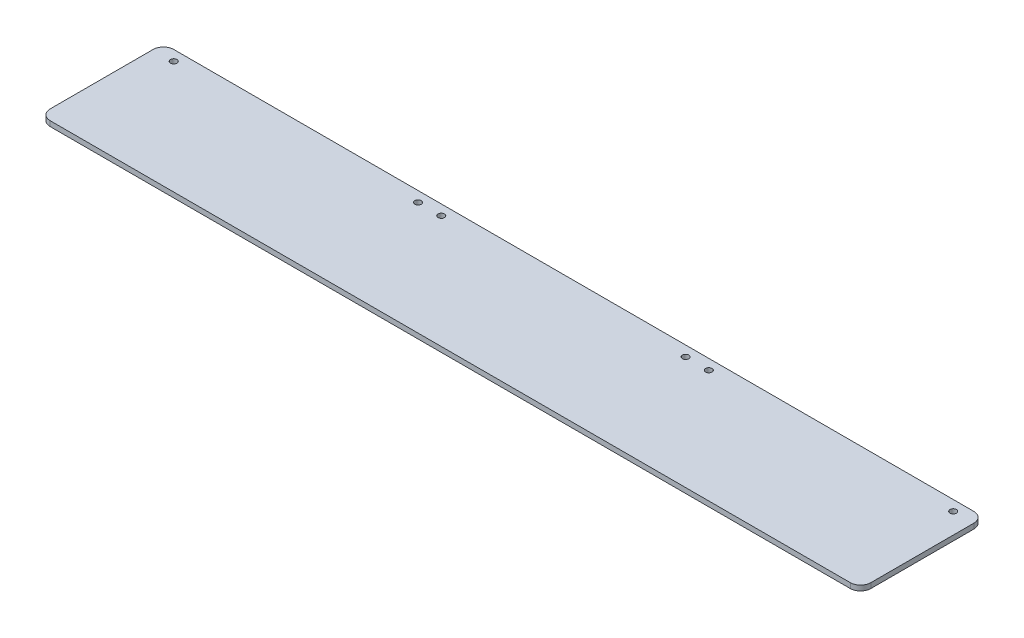
ISO-10303-21;
HEADER;
FILE_DESCRIPTION(('STEP AP214'),'2;1');
FILE_NAME('part.step','',(''),(''),'','','');
FILE_SCHEMA(('AUTOMOTIVE_DESIGN { 1 0 10303 214 1 1 1 1 }'));
ENDSEC;
DATA;
#1=APPLICATION_CONTEXT('core data for automotive mechanical design processes');
#2=APPLICATION_PROTOCOL_DEFINITION('international standard','automotive_design',2000,#1);
#3=PRODUCT_CONTEXT('',#1,'mechanical');
#4=PRODUCT('Part','Part','',(#3));
#5=PRODUCT_RELATED_PRODUCT_CATEGORY('part','',(#4));
#6=PRODUCT_DEFINITION_FORMATION('','',#4);
#7=PRODUCT_DEFINITION_CONTEXT('part definition',#1,'design');
#8=PRODUCT_DEFINITION('design','',#6,#7);
#9=PRODUCT_DEFINITION_SHAPE('','',#8);
#10=(LENGTH_UNIT() NAMED_UNIT(*) SI_UNIT(.MILLI.,.METRE.));
#11=(NAMED_UNIT(*) PLANE_ANGLE_UNIT() SI_UNIT($,.RADIAN.));
#12=(NAMED_UNIT(*) SI_UNIT($,.STERADIAN.) SOLID_ANGLE_UNIT());
#13=UNCERTAINTY_MEASURE_WITH_UNIT(LENGTH_MEASURE(1.E-05),#10,'distance_accuracy_value','');
#14=(GEOMETRIC_REPRESENTATION_CONTEXT(3) GLOBAL_UNCERTAINTY_ASSIGNED_CONTEXT((#13)) GLOBAL_UNIT_ASSIGNED_CONTEXT((#10,
#11,#12)) REPRESENTATION_CONTEXT('',''));
#15=CARTESIAN_POINT('',(0.,0.,0.));
#16=DIRECTION('',(0.,0.,1.));
#17=DIRECTION('',(1.,0.,0.));
#18=AXIS2_PLACEMENT_3D('',#15,#16,#17);
#19=CARTESIAN_POINT('',(2000.25000000001,12.7,-25.4));
#20=DIRECTION('',(0.,-1.,0.));
#21=DIRECTION('',(0.,0.,-1.));
#22=AXIS2_PLACEMENT_3D('',#19,#20,#21);
#23=PLANE('',#22);
#24=CARTESIAN_POINT('',(2000.25000000001,12.7,-25.4));
#25=DIRECTION('',(0.,1.,0.));
#26=DIRECTION('',(0.,0.,-1.));
#27=AXIS2_PLACEMENT_3D('',#24,#25,#26);
#28=CIRCLE('',#27,25.3999999999999);
#29=CARTESIAN_POINT('',(2000.25000000001,12.7,0.));
#30=VERTEX_POINT('',#29);
#31=CARTESIAN_POINT('',(2025.65000000001,12.7,-25.4));
#32=VERTEX_POINT('',#31);
#33=EDGE_CURVE('E146',#30,#32,#28,.T.);
#34=ORIENTED_EDGE('',*,*,#33,.T.);
#35=DIRECTION('',(0.,0.,-1.));
#36=VECTOR('',#35,1.);
#37=CARTESIAN_POINT('',(2025.65000000001,12.7,-25.4));
#38=LINE('',#37,#36);
#39=CARTESIAN_POINT('',(2025.65000000001,12.7,-279.4));
#40=VERTEX_POINT('',#39);
#41=EDGE_CURVE('E94',#32,#40,#38,.T.);
#42=ORIENTED_EDGE('',*,*,#41,.T.);
#43=CARTESIAN_POINT('',(2000.25000000001,12.7,-279.4));
#44=DIRECTION('',(0.,1.,0.));
#45=DIRECTION('',(0.,0.,-1.));
#46=AXIS2_PLACEMENT_3D('',#43,#44,#45);
#47=CIRCLE('',#46,25.3999999999999);
#48=CARTESIAN_POINT('',(2000.25000000001,12.7,-304.8));
#49=VERTEX_POINT('',#48);
#50=EDGE_CURVE('E161',#40,#49,#47,.T.);
#51=ORIENTED_EDGE('',*,*,#50,.T.);
#52=DIRECTION('',(-1.,0.,0.));
#53=VECTOR('',#52,1.);
#54=CARTESIAN_POINT('',(25.3999999999996,12.7,-304.800000000007));
#55=LINE('',#54,#53);
#56=CARTESIAN_POINT('',(25.3999999999996,12.7,-304.800000000007));
#57=VERTEX_POINT('',#56);
#58=EDGE_CURVE('E174',#49,#57,#55,.T.);
#59=ORIENTED_EDGE('',*,*,#58,.T.);
#60=CARTESIAN_POINT('',(25.4,12.7,-279.40000000002));
#61=DIRECTION('',(0.,1.,0.));
#62=DIRECTION('',(0.,0.,-1.));
#63=AXIS2_PLACEMENT_3D('',#60,#61,#62);
#64=CIRCLE('',#63,25.3999999999933);
#65=CARTESIAN_POINT('',(6.6717464886068E-12,12.7,-279.400000000007));
#66=VERTEX_POINT('',#65);
#67=EDGE_CURVE('E113',#57,#66,#64,.T.);
#68=ORIENTED_EDGE('',*,*,#67,.T.);
#69=DIRECTION('',(0.,0.,1.));
#70=VECTOR('',#69,1.);
#71=CARTESIAN_POINT('',(0.,12.7,-25.4000000000002));
#72=LINE('',#71,#70);
#73=CARTESIAN_POINT('',(0.,12.7,-25.4000000000002));
#74=VERTEX_POINT('',#73);
#75=EDGE_CURVE('E107',#66,#74,#72,.T.);
#76=ORIENTED_EDGE('',*,*,#75,.T.);
#77=CARTESIAN_POINT('',(25.4,12.7,-25.4));
#78=DIRECTION('',(0.,1.,0.));
#79=DIRECTION('',(0.,0.,1.));
#80=AXIS2_PLACEMENT_3D('',#77,#78,#79);
#81=CIRCLE('',#80,25.4);
#82=CARTESIAN_POINT('',(25.4,12.7,0.));
#83=VERTEX_POINT('',#82);
#84=EDGE_CURVE('E111',#74,#83,#81,.T.);
#85=ORIENTED_EDGE('',*,*,#84,.T.);
#86=DIRECTION('',(1.,0.,0.));
#87=VECTOR('',#86,1.);
#88=CARTESIAN_POINT('',(25.4000000000002,12.7,0.));
#89=LINE('',#88,#87);
#90=EDGE_CURVE('E51',#83,#30,#89,.T.);
#91=ORIENTED_EDGE('',*,*,#90,.T.);
#92=EDGE_LOOP('',(#34,#42,#51,#59,#68,#76,#85,#91));
#93=FACE_BOUND('',#92,.T.);
#94=CARTESIAN_POINT('',(50.8,12.7,-279.400000000007));
#95=DIRECTION('',(0.,1.,0.));
#96=DIRECTION('',(0.,0.,1.));
#97=AXIS2_PLACEMENT_3D('',#94,#95,#96);
#98=CIRCLE('',#97,7.93749999999794);
#99=CARTESIAN_POINT('',(50.8,12.7,-271.462500000009));
#100=VERTEX_POINT('',#99);
#101=EDGE_CURVE('E135',#100,#100,#98,.T.);
#102=ORIENTED_EDGE('',*,*,#101,.F.);
#103=EDGE_LOOP('',(#102));
#104=FACE_BOUND('',#103,.T.);
#105=CARTESIAN_POINT('',(654.05,12.7,-279.399999999999));
#106=DIRECTION('',(0.,1.,0.));
#107=DIRECTION('',(0.,0.,1.));
#108=AXIS2_PLACEMENT_3D('',#105,#106,#107);
#109=CIRCLE('',#108,7.93750000000026);
#110=CARTESIAN_POINT('',(654.05,12.7,-271.462499999999));
#111=VERTEX_POINT('',#110);
#112=EDGE_CURVE('E183',#111,#111,#109,.T.);
#113=ORIENTED_EDGE('',*,*,#112,.F.);
#114=EDGE_LOOP('',(#113));
#115=FACE_BOUND('',#114,.T.);
#116=CARTESIAN_POINT('',(711.2,12.7,-279.4));
#117=DIRECTION('',(0.,1.,0.));
#118=DIRECTION('',(0.,0.,1.));
#119=AXIS2_PLACEMENT_3D('',#116,#117,#118);
#120=CIRCLE('',#119,7.93750000000026);
#121=CARTESIAN_POINT('',(711.2,12.7,-271.4625));
#122=VERTEX_POINT('',#121);
#123=EDGE_CURVE('E189',#122,#122,#120,.T.);
#124=ORIENTED_EDGE('',*,*,#123,.F.);
#125=EDGE_LOOP('',(#124));
#126=FACE_BOUND('',#125,.T.);
#127=CARTESIAN_POINT('',(1314.45000000001,12.7,-279.400000000001));
#128=DIRECTION('',(0.,1.,0.));
#129=DIRECTION('',(0.,0.,-1.));
#130=AXIS2_PLACEMENT_3D('',#127,#128,#129);
#131=CIRCLE('',#130,7.93750000000044);
#132=CARTESIAN_POINT('',(1314.45000000001,12.7,-287.337500000001));
#133=VERTEX_POINT('',#132);
#134=EDGE_CURVE('E195',#133,#133,#131,.T.);
#135=ORIENTED_EDGE('',*,*,#134,.F.);
#136=EDGE_LOOP('',(#135));
#137=FACE_BOUND('',#136,.T.);
#138=CARTESIAN_POINT('',(1371.60000000001,12.7,-279.4));
#139=DIRECTION('',(0.,1.,0.));
#140=DIRECTION('',(0.,0.,-1.));
#141=AXIS2_PLACEMENT_3D('',#138,#139,#140);
#142=CIRCLE('',#141,7.93750000000089);
#143=CARTESIAN_POINT('',(1371.60000000001,12.7,-287.337500000001));
#144=VERTEX_POINT('',#143);
#145=EDGE_CURVE('E201',#144,#144,#142,.T.);
#146=ORIENTED_EDGE('',*,*,#145,.F.);
#147=EDGE_LOOP('',(#146));
#148=FACE_BOUND('',#147,.T.);
#149=CARTESIAN_POINT('',(1974.85000000001,12.7,-279.4));
#150=DIRECTION('',(0.,1.,0.));
#151=DIRECTION('',(0.,0.,-1.));
#152=AXIS2_PLACEMENT_3D('',#149,#150,#151);
#153=CIRCLE('',#152,7.93749999999998);
#154=CARTESIAN_POINT('',(1974.85000000001,12.7,-287.3375));
#155=VERTEX_POINT('',#154);
#156=EDGE_CURVE('E207',#155,#155,#153,.T.);
#157=ORIENTED_EDGE('',*,*,#156,.F.);
#158=EDGE_LOOP('',(#157));
#159=FACE_BOUND('',#158,.T.);
#160=ADVANCED_FACE('F34',(#93,#104,#115,#126,#137,#148,#159),#23,.F.);
#161=CARTESIAN_POINT('',(2000.25000000001,0.,-25.4));
#162=DIRECTION('',(0.,-1.,0.));
#163=DIRECTION('',(0.,0.,-1.));
#164=AXIS2_PLACEMENT_3D('',#161,#162,#163);
#165=PLANE('',#164);
#166=CARTESIAN_POINT('',(1371.60000000001,0.,-279.4));
#167=DIRECTION('',(0.,1.,0.));
#168=DIRECTION('',(0.,0.,-1.));
#169=AXIS2_PLACEMENT_3D('',#166,#167,#168);
#170=CIRCLE('',#169,7.93750000000089);
#171=CARTESIAN_POINT('',(1371.60000000001,0.,-287.337500000001));
#172=VERTEX_POINT('',#171);
#173=EDGE_CURVE('E204',#172,#172,#170,.T.);
#174=ORIENTED_EDGE('',*,*,#173,.T.);
#175=EDGE_LOOP('',(#174));
#176=FACE_BOUND('',#175,.T.);
#177=CARTESIAN_POINT('',(711.2,0.,-279.4));
#178=DIRECTION('',(0.,1.,0.));
#179=DIRECTION('',(0.,0.,1.));
#180=AXIS2_PLACEMENT_3D('',#177,#178,#179);
#181=CIRCLE('',#180,7.93750000000026);
#182=CARTESIAN_POINT('',(711.2,0.,-271.4625));
#183=VERTEX_POINT('',#182);
#184=EDGE_CURVE('E192',#183,#183,#181,.T.);
#185=ORIENTED_EDGE('',*,*,#184,.T.);
#186=EDGE_LOOP('',(#185));
#187=FACE_BOUND('',#186,.T.);
#188=CARTESIAN_POINT('',(50.8,0.,-279.400000000007));
#189=DIRECTION('',(0.,1.,0.));
#190=DIRECTION('',(0.,0.,1.));
#191=AXIS2_PLACEMENT_3D('',#188,#189,#190);
#192=CIRCLE('',#191,7.93749999999794);
#193=CARTESIAN_POINT('',(50.8,0.,-271.462500000009));
#194=VERTEX_POINT('',#193);
#195=EDGE_CURVE('E180',#194,#194,#192,.T.);
#196=ORIENTED_EDGE('',*,*,#195,.T.);
#197=EDGE_LOOP('',(#196));
#198=FACE_BOUND('',#197,.T.);
#199=CARTESIAN_POINT('',(2000.25000000001,0.,-25.4));
#200=DIRECTION('',(0.,1.,0.));
#201=DIRECTION('',(0.,0.,-1.));
#202=AXIS2_PLACEMENT_3D('',#199,#200,#201);
#203=CIRCLE('',#202,25.3999999999999);
#204=CARTESIAN_POINT('',(2000.25000000001,0.,0.));
#205=VERTEX_POINT('',#204);
#206=CARTESIAN_POINT('',(2025.65000000001,0.,-25.4));
#207=VERTEX_POINT('',#206);
#208=EDGE_CURVE('E131',#205,#207,#203,.T.);
#209=ORIENTED_EDGE('',*,*,#208,.F.);
#210=DIRECTION('',(1.,0.,0.));
#211=VECTOR('',#210,1.);
#212=CARTESIAN_POINT('',(25.4000000000002,0.,0.));
#213=LINE('',#212,#211);
#214=CARTESIAN_POINT('',(25.4,0.,0.));
#215=VERTEX_POINT('',#214);
#216=EDGE_CURVE('E86',#215,#205,#213,.T.);
#217=ORIENTED_EDGE('',*,*,#216,.F.);
#218=CARTESIAN_POINT('',(25.4,0.,-25.4));
#219=DIRECTION('',(0.,1.,0.));
#220=DIRECTION('',(0.,0.,1.));
#221=AXIS2_PLACEMENT_3D('',#218,#219,#220);
#222=CIRCLE('',#221,25.4);
#223=CARTESIAN_POINT('',(0.,0.,-25.4000000000002));
#224=VERTEX_POINT('',#223);
#225=EDGE_CURVE('E80',#224,#215,#222,.T.);
#226=ORIENTED_EDGE('',*,*,#225,.F.);
#227=DIRECTION('',(0.,0.,1.));
#228=VECTOR('',#227,1.);
#229=CARTESIAN_POINT('',(0.,0.,-25.4000000000002));
#230=LINE('',#229,#228);
#231=CARTESIAN_POINT('',(6.6717464886068E-12,0.,-279.400000000007));
#232=VERTEX_POINT('',#231);
#233=EDGE_CURVE('E121',#232,#224,#230,.T.);
#234=ORIENTED_EDGE('',*,*,#233,.F.);
#235=CARTESIAN_POINT('',(25.4,0.,-279.40000000002));
#236=DIRECTION('',(0.,1.,0.));
#237=DIRECTION('',(0.,0.,-1.));
#238=AXIS2_PLACEMENT_3D('',#235,#236,#237);
#239=CIRCLE('',#238,25.3999999999933);
#240=CARTESIAN_POINT('',(25.3999999999996,0.,-304.800000000007));
#241=VERTEX_POINT('',#240);
#242=EDGE_CURVE('E141',#241,#232,#239,.T.);
#243=ORIENTED_EDGE('',*,*,#242,.F.);
#244=DIRECTION('',(-1.,0.,0.));
#245=VECTOR('',#244,1.);
#246=CARTESIAN_POINT('',(25.3999999999996,0.,-304.800000000007));
#247=LINE('',#246,#245);
#248=CARTESIAN_POINT('',(2000.25000000001,0.,-304.8));
#249=VERTEX_POINT('',#248);
#250=EDGE_CURVE('E139',#249,#241,#247,.T.);
#251=ORIENTED_EDGE('',*,*,#250,.F.);
#252=CARTESIAN_POINT('',(2000.25000000001,0.,-279.4));
#253=DIRECTION('',(0.,1.,0.));
#254=DIRECTION('',(0.,0.,-1.));
#255=AXIS2_PLACEMENT_3D('',#252,#253,#254);
#256=CIRCLE('',#255,25.3999999999999);
#257=CARTESIAN_POINT('',(2025.65000000001,0.,-279.4));
#258=VERTEX_POINT('',#257);
#259=EDGE_CURVE('E137',#258,#249,#256,.T.);
#260=ORIENTED_EDGE('',*,*,#259,.F.);
#261=DIRECTION('',(0.,0.,-1.));
#262=VECTOR('',#261,1.);
#263=CARTESIAN_POINT('',(2025.65000000001,0.,-25.4));
#264=LINE('',#263,#262);
#265=EDGE_CURVE('E134',#207,#258,#264,.T.);
#266=ORIENTED_EDGE('',*,*,#265,.F.);
#267=EDGE_LOOP('',(#209,#217,#226,#234,#243,#251,#260,#266));
#268=FACE_BOUND('',#267,.T.);
#269=CARTESIAN_POINT('',(654.05,0.,-279.399999999999));
#270=DIRECTION('',(0.,1.,0.));
#271=DIRECTION('',(0.,0.,1.));
#272=AXIS2_PLACEMENT_3D('',#269,#270,#271);
#273=CIRCLE('',#272,7.93750000000026);
#274=CARTESIAN_POINT('',(654.05,0.,-271.462499999999));
#275=VERTEX_POINT('',#274);
#276=EDGE_CURVE('E186',#275,#275,#273,.T.);
#277=ORIENTED_EDGE('',*,*,#276,.T.);
#278=EDGE_LOOP('',(#277));
#279=FACE_BOUND('',#278,.T.);
#280=CARTESIAN_POINT('',(1314.45000000001,0.,-279.400000000001));
#281=DIRECTION('',(0.,1.,0.));
#282=DIRECTION('',(0.,0.,-1.));
#283=AXIS2_PLACEMENT_3D('',#280,#281,#282);
#284=CIRCLE('',#283,7.93750000000044);
#285=CARTESIAN_POINT('',(1314.45000000001,0.,-287.337500000001));
#286=VERTEX_POINT('',#285);
#287=EDGE_CURVE('E198',#286,#286,#284,.T.);
#288=ORIENTED_EDGE('',*,*,#287,.T.);
#289=EDGE_LOOP('',(#288));
#290=FACE_BOUND('',#289,.T.);
#291=CARTESIAN_POINT('',(1974.85000000001,0.,-279.4));
#292=DIRECTION('',(0.,1.,0.));
#293=DIRECTION('',(0.,0.,-1.));
#294=AXIS2_PLACEMENT_3D('',#291,#292,#293);
#295=CIRCLE('',#294,7.93749999999998);
#296=CARTESIAN_POINT('',(1974.85000000001,0.,-287.3375));
#297=VERTEX_POINT('',#296);
#298=EDGE_CURVE('E210',#297,#297,#295,.T.);
#299=ORIENTED_EDGE('',*,*,#298,.T.);
#300=EDGE_LOOP('',(#299));
#301=FACE_BOUND('',#300,.T.);
#302=ADVANCED_FACE('F165',(#176,#187,#198,#268,#279,#290,#301),#165,.T.);
#303=CARTESIAN_POINT('',(2000.25000000001,12.7,-25.4));
#304=DIRECTION('',(0.,-1.,0.));
#305=DIRECTION('',(0.,0.,-1.));
#306=AXIS2_PLACEMENT_3D('',#303,#304,#305);
#307=CYLINDRICAL_SURFACE('',#306,25.3999999999999);
#308=ORIENTED_EDGE('',*,*,#208,.T.);
#309=DIRECTION('',(0.,-1.,0.));
#310=VECTOR('',#309,1.);
#311=CARTESIAN_POINT('',(2025.65000000001,12.7,-25.4));
#312=LINE('',#311,#310);
#313=EDGE_CURVE('E11',#32,#207,#312,.T.);
#314=ORIENTED_EDGE('',*,*,#313,.F.);
#315=ORIENTED_EDGE('',*,*,#33,.F.);
#316=DIRECTION('',(0.,-1.,0.));
#317=VECTOR('',#316,1.);
#318=CARTESIAN_POINT('',(2000.25000000001,12.7,0.));
#319=LINE('',#318,#317);
#320=EDGE_CURVE('E127',#30,#205,#319,.T.);
#321=ORIENTED_EDGE('',*,*,#320,.T.);
#322=EDGE_LOOP('',(#308,#314,#315,#321));
#323=FACE_BOUND('',#322,.T.);
#324=ADVANCED_FACE('F36',(#323),#307,.T.);
#325=CARTESIAN_POINT('',(2025.65000000001,12.7,-25.4));
#326=DIRECTION('',(-1.,0.,0.));
#327=DIRECTION('',(0.,0.,1.));
#328=AXIS2_PLACEMENT_3D('',#325,#326,#327);
#329=PLANE('',#328);
#330=ORIENTED_EDGE('',*,*,#265,.T.);
#331=DIRECTION('',(0.,-1.,0.));
#332=VECTOR('',#331,1.);
#333=CARTESIAN_POINT('',(2025.65000000001,12.7,-279.4));
#334=LINE('',#333,#332);
#335=EDGE_CURVE('E43',#40,#258,#334,.T.);
#336=ORIENTED_EDGE('',*,*,#335,.F.);
#337=ORIENTED_EDGE('',*,*,#41,.F.);
#338=ORIENTED_EDGE('',*,*,#313,.T.);
#339=EDGE_LOOP('',(#330,#336,#337,#338));
#340=FACE_BOUND('',#339,.T.);
#341=ADVANCED_FACE('F242',(#340),#329,.F.);
#342=CARTESIAN_POINT('',(2000.25000000001,12.7,-279.4));
#343=DIRECTION('',(0.,-1.,0.));
#344=DIRECTION('',(0.,0.,-1.));
#345=AXIS2_PLACEMENT_3D('',#342,#343,#344);
#346=CYLINDRICAL_SURFACE('',#345,25.3999999999999);
#347=ORIENTED_EDGE('',*,*,#259,.T.);
#348=DIRECTION('',(0.,-1.,0.));
#349=VECTOR('',#348,1.);
#350=CARTESIAN_POINT('',(2000.25000000001,12.7,-304.8));
#351=LINE('',#350,#349);
#352=EDGE_CURVE('E153',#49,#249,#351,.T.);
#353=ORIENTED_EDGE('',*,*,#352,.F.);
#354=ORIENTED_EDGE('',*,*,#50,.F.);
#355=ORIENTED_EDGE('',*,*,#335,.T.);
#356=EDGE_LOOP('',(#347,#353,#354,#355));
#357=FACE_BOUND('',#356,.T.);
#358=ADVANCED_FACE('F159',(#357),#346,.T.);
#359=CARTESIAN_POINT('',(25.3999999999996,12.7,-304.800000000007));
#360=DIRECTION('',(0.,0.,1.));
#361=DIRECTION('',(1.,0.,0.));
#362=AXIS2_PLACEMENT_3D('',#359,#360,#361);
#363=PLANE('',#362);
#364=ORIENTED_EDGE('',*,*,#250,.T.);
#365=DIRECTION('',(0.,-1.,0.));
#366=VECTOR('',#365,1.);
#367=CARTESIAN_POINT('',(25.3999999999996,12.7,-304.800000000007));
#368=LINE('',#367,#366);
#369=EDGE_CURVE('E150',#57,#241,#368,.T.);
#370=ORIENTED_EDGE('',*,*,#369,.F.);
#371=ORIENTED_EDGE('',*,*,#58,.F.);
#372=ORIENTED_EDGE('',*,*,#352,.T.);
#373=EDGE_LOOP('',(#364,#370,#371,#372));
#374=FACE_BOUND('',#373,.T.);
#375=ADVANCED_FACE('F170',(#374),#363,.F.);
#376=CARTESIAN_POINT('',(25.4,12.7,-279.40000000002));
#377=DIRECTION('',(0.,-1.,0.));
#378=DIRECTION('',(0.,0.,-1.));
#379=AXIS2_PLACEMENT_3D('',#376,#377,#378);
#380=CYLINDRICAL_SURFACE('',#379,25.3999999999933);
#381=ORIENTED_EDGE('',*,*,#242,.T.);
#382=DIRECTION('',(0.,-1.,0.));
#383=VECTOR('',#382,1.);
#384=CARTESIAN_POINT('',(6.6717464886068E-12,12.7,-279.400000000007));
#385=LINE('',#384,#383);
#386=EDGE_CURVE('E122',#66,#232,#385,.T.);
#387=ORIENTED_EDGE('',*,*,#386,.F.);
#388=ORIENTED_EDGE('',*,*,#67,.F.);
#389=ORIENTED_EDGE('',*,*,#369,.T.);
#390=EDGE_LOOP('',(#381,#387,#388,#389));
#391=FACE_BOUND('',#390,.T.);
#392=ADVANCED_FACE('F173',(#391),#380,.T.);
#393=CARTESIAN_POINT('',(0.,12.7,-25.4000000000002));
#394=DIRECTION('',(1.,0.,0.));
#395=DIRECTION('',(0.,0.,-1.));
#396=AXIS2_PLACEMENT_3D('',#393,#394,#395);
#397=PLANE('',#396);
#398=ORIENTED_EDGE('',*,*,#233,.T.);
#399=DIRECTION('',(0.,-1.,0.));
#400=VECTOR('',#399,1.);
#401=CARTESIAN_POINT('',(0.,12.7,-25.4000000000002));
#402=LINE('',#401,#400);
#403=EDGE_CURVE('E118',#74,#224,#402,.T.);
#404=ORIENTED_EDGE('',*,*,#403,.F.);
#405=ORIENTED_EDGE('',*,*,#75,.F.);
#406=ORIENTED_EDGE('',*,*,#386,.T.);
#407=EDGE_LOOP('',(#398,#404,#405,#406));
#408=FACE_BOUND('',#407,.T.);
#409=ADVANCED_FACE('F119',(#408),#397,.F.);
#410=CARTESIAN_POINT('',(25.4,12.7,-25.4));
#411=DIRECTION('',(0.,-1.,0.));
#412=DIRECTION('',(0.,0.,-1.));
#413=AXIS2_PLACEMENT_3D('',#410,#411,#412);
#414=CYLINDRICAL_SURFACE('',#413,25.4);
#415=ORIENTED_EDGE('',*,*,#225,.T.);
#416=DIRECTION('',(0.,-1.,0.));
#417=VECTOR('',#416,1.);
#418=CARTESIAN_POINT('',(25.4,12.7,0.));
#419=LINE('',#418,#417);
#420=EDGE_CURVE('E123',#83,#215,#419,.T.);
#421=ORIENTED_EDGE('',*,*,#420,.F.);
#422=ORIENTED_EDGE('',*,*,#84,.F.);
#423=ORIENTED_EDGE('',*,*,#403,.T.);
#424=EDGE_LOOP('',(#415,#421,#422,#423));
#425=FACE_BOUND('',#424,.T.);
#426=ADVANCED_FACE('F125',(#425),#414,.T.);
#427=CARTESIAN_POINT('',(25.4000000000002,12.7,0.));
#428=DIRECTION('',(0.,0.,-1.));
#429=DIRECTION('',(-1.,0.,0.));
#430=AXIS2_PLACEMENT_3D('',#427,#428,#429);
#431=PLANE('',#430);
#432=ORIENTED_EDGE('',*,*,#216,.T.);
#433=ORIENTED_EDGE('',*,*,#320,.F.);
#434=ORIENTED_EDGE('',*,*,#90,.F.);
#435=ORIENTED_EDGE('',*,*,#420,.T.);
#436=EDGE_LOOP('',(#432,#433,#434,#435));
#437=FACE_BOUND('',#436,.T.);
#438=ADVANCED_FACE('F230',(#437),#431,.F.);
#439=CARTESIAN_POINT('',(50.8,12.7,-279.400000000007));
#440=DIRECTION('',(0.,-1.,0.));
#441=DIRECTION('',(0.,0.,-1.));
#442=AXIS2_PLACEMENT_3D('',#439,#440,#441);
#443=CYLINDRICAL_SURFACE('',#442,7.93749999999794);
#444=ORIENTED_EDGE('',*,*,#101,.T.);
#445=EDGE_LOOP('',(#444));
#446=FACE_BOUND('',#445,.T.);
#447=ORIENTED_EDGE('',*,*,#195,.F.);
#448=EDGE_LOOP('',(#447));
#449=FACE_BOUND('',#448,.T.);
#450=ADVANCED_FACE('F227',(#446,#449),#443,.F.);
#451=CARTESIAN_POINT('',(654.05,12.7,-279.399999999999));
#452=DIRECTION('',(0.,-1.,0.));
#453=DIRECTION('',(0.,0.,-1.));
#454=AXIS2_PLACEMENT_3D('',#451,#452,#453);
#455=CYLINDRICAL_SURFACE('',#454,7.93750000000026);
#456=ORIENTED_EDGE('',*,*,#112,.T.);
#457=EDGE_LOOP('',(#456));
#458=FACE_BOUND('',#457,.T.);
#459=ORIENTED_EDGE('',*,*,#276,.F.);
#460=EDGE_LOOP('',(#459));
#461=FACE_BOUND('',#460,.T.);
#462=ADVANCED_FACE('F306',(#458,#461),#455,.F.);
#463=CARTESIAN_POINT('',(711.2,12.7,-279.4));
#464=DIRECTION('',(0.,-1.,0.));
#465=DIRECTION('',(0.,0.,-1.));
#466=AXIS2_PLACEMENT_3D('',#463,#464,#465);
#467=CYLINDRICAL_SURFACE('',#466,7.93750000000026);
#468=ORIENTED_EDGE('',*,*,#123,.T.);
#469=EDGE_LOOP('',(#468));
#470=FACE_BOUND('',#469,.T.);
#471=ORIENTED_EDGE('',*,*,#184,.F.);
#472=EDGE_LOOP('',(#471));
#473=FACE_BOUND('',#472,.T.);
#474=ADVANCED_FACE('F314',(#470,#473),#467,.F.);
#475=CARTESIAN_POINT('',(1314.45000000001,12.7,-279.400000000001));
#476=DIRECTION('',(0.,-1.,0.));
#477=DIRECTION('',(0.,0.,-1.));
#478=AXIS2_PLACEMENT_3D('',#475,#476,#477);
#479=CYLINDRICAL_SURFACE('',#478,7.93750000000044);
#480=ORIENTED_EDGE('',*,*,#134,.T.);
#481=EDGE_LOOP('',(#480));
#482=FACE_BOUND('',#481,.T.);
#483=ORIENTED_EDGE('',*,*,#287,.F.);
#484=EDGE_LOOP('',(#483));
#485=FACE_BOUND('',#484,.T.);
#486=ADVANCED_FACE('F322',(#482,#485),#479,.F.);
#487=CARTESIAN_POINT('',(1371.60000000001,12.7,-279.4));
#488=DIRECTION('',(0.,-1.,0.));
#489=DIRECTION('',(0.,0.,-1.));
#490=AXIS2_PLACEMENT_3D('',#487,#488,#489);
#491=CYLINDRICAL_SURFACE('',#490,7.93750000000089);
#492=ORIENTED_EDGE('',*,*,#145,.T.);
#493=EDGE_LOOP('',(#492));
#494=FACE_BOUND('',#493,.T.);
#495=ORIENTED_EDGE('',*,*,#173,.F.);
#496=EDGE_LOOP('',(#495));
#497=FACE_BOUND('',#496,.T.);
#498=ADVANCED_FACE('F331',(#494,#497),#491,.F.);
#499=CARTESIAN_POINT('',(1974.85000000001,12.7,-279.4));
#500=DIRECTION('',(0.,-1.,0.));
#501=DIRECTION('',(0.,0.,-1.));
#502=AXIS2_PLACEMENT_3D('',#499,#500,#501);
#503=CYLINDRICAL_SURFACE('',#502,7.93749999999998);
#504=ORIENTED_EDGE('',*,*,#156,.T.);
#505=EDGE_LOOP('',(#504));
#506=FACE_BOUND('',#505,.T.);
#507=ORIENTED_EDGE('',*,*,#298,.F.);
#508=EDGE_LOOP('',(#507));
#509=FACE_BOUND('',#508,.T.);
#510=ADVANCED_FACE('F216',(#506,#509),#503,.F.);
#511=CLOSED_SHELL('',(#160,#302,#324,#341,#358,#375,#392,#409,#426,#438,#450,#462,#474,#486,
#498,#510));
#512=MANIFOLD_SOLID_BREP('B2',#511);
#513=ADVANCED_BREP_SHAPE_REPRESENTATION('',(#18,#512),#14);
#514=SHAPE_DEFINITION_REPRESENTATION(#9,#513);
ENDSEC;
END-ISO-10303-21;
